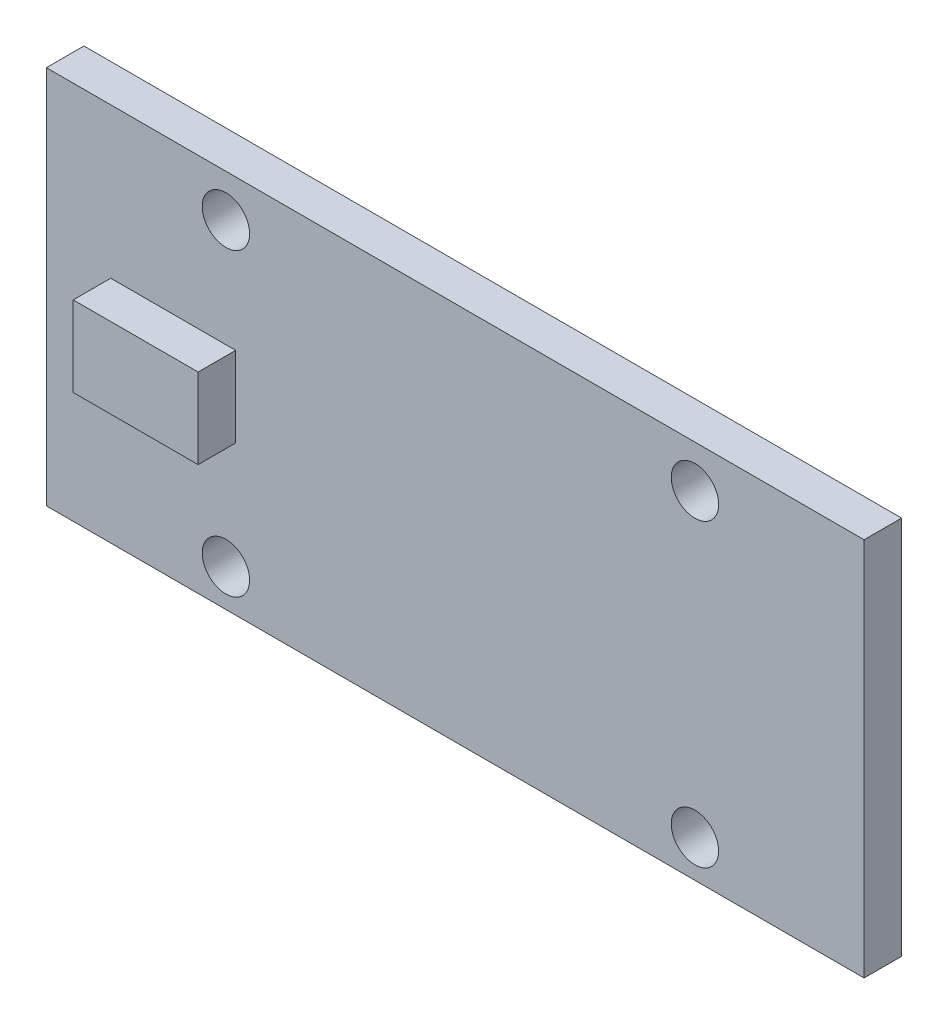
ISO-10303-21;
HEADER;
FILE_DESCRIPTION(('STEP AP214'),'2;1');
FILE_NAME('part.step','',(''),(''),'','','');
FILE_SCHEMA(('AUTOMOTIVE_DESIGN { 1 0 10303 214 1 1 1 1 }'));
ENDSEC;
DATA;
#1=APPLICATION_CONTEXT('core data for automotive mechanical design processes');
#2=APPLICATION_PROTOCOL_DEFINITION('international standard','automotive_design',2000,#1);
#3=PRODUCT_CONTEXT('',#1,'mechanical');
#4=PRODUCT('Part','Part','',(#3));
#5=PRODUCT_RELATED_PRODUCT_CATEGORY('part','',(#4));
#6=PRODUCT_DEFINITION_FORMATION('','',#4);
#7=PRODUCT_DEFINITION_CONTEXT('part definition',#1,'design');
#8=PRODUCT_DEFINITION('design','',#6,#7);
#9=PRODUCT_DEFINITION_SHAPE('','',#8);
#10=(LENGTH_UNIT() NAMED_UNIT(*) SI_UNIT(.MILLI.,.METRE.));
#11=(NAMED_UNIT(*) PLANE_ANGLE_UNIT() SI_UNIT($,.RADIAN.));
#12=(NAMED_UNIT(*) SI_UNIT($,.STERADIAN.) SOLID_ANGLE_UNIT());
#13=UNCERTAINTY_MEASURE_WITH_UNIT(LENGTH_MEASURE(1.E-05),#10,'distance_accuracy_value','');
#14=(GEOMETRIC_REPRESENTATION_CONTEXT(3) GLOBAL_UNCERTAINTY_ASSIGNED_CONTEXT((#13)) GLOBAL_UNIT_ASSIGNED_CONTEXT((#10,
#11,#12)) REPRESENTATION_CONTEXT('',''));
#15=CARTESIAN_POINT('',(0.,0.,0.));
#16=DIRECTION('',(0.,0.,1.));
#17=DIRECTION('',(1.,0.,0.));
#18=AXIS2_PLACEMENT_3D('',#15,#16,#17);
#19=CARTESIAN_POINT('',(0.,0.,2.54));
#20=DIRECTION('',(0.,0.,-1.));
#21=DIRECTION('',(-1.,0.,0.));
#22=AXIS2_PLACEMENT_3D('',#19,#20,#21);
#23=PLANE('',#22);
#24=CARTESIAN_POINT('',(12.1521793794001,22.833985209276,2.54));
#25=DIRECTION('',(0.,0.,1.));
#26=DIRECTION('',(1.,0.,0.));
#27=AXIS2_PLACEMENT_3D('',#24,#25,#26);
#28=CIRCLE('',#27,1.60457553684994);
#29=CARTESIAN_POINT('',(13.75675491625,22.833985209276,2.54));
#30=VERTEX_POINT('',#29);
#31=EDGE_CURVE('E122',#30,#30,#28,.T.);
#32=ORIENTED_EDGE('',*,*,#31,.F.);
#33=EDGE_LOOP('',(#32));
#34=FACE_BOUND('',#33,.T.);
#35=CARTESIAN_POINT('',(43.9021793794001,22.833985209276,2.54));
#36=DIRECTION('',(0.,0.,1.));
#37=DIRECTION('',(1.,0.,0.));
#38=AXIS2_PLACEMENT_3D('',#35,#36,#37);
#39=CIRCLE('',#38,1.60457553684994);
#40=CARTESIAN_POINT('',(45.50675491625,22.833985209276,2.54));
#41=VERTEX_POINT('',#40);
#42=EDGE_CURVE('E131',#41,#41,#39,.T.);
#43=ORIENTED_EDGE('',*,*,#42,.F.);
#44=EDGE_LOOP('',(#43));
#45=FACE_BOUND('',#44,.T.);
#46=CARTESIAN_POINT('',(43.9021793794002,2.51398520927599,2.54));
#47=DIRECTION('',(0.,0.,1.));
#48=DIRECTION('',(1.,0.,0.));
#49=AXIS2_PLACEMENT_3D('',#46,#47,#48);
#50=CIRCLE('',#49,1.60457553684994);
#51=CARTESIAN_POINT('',(45.5067549162501,2.51398520927599,2.54));
#52=VERTEX_POINT('',#51);
#53=EDGE_CURVE('E137',#52,#52,#50,.T.);
#54=ORIENTED_EDGE('',*,*,#53,.F.);
#55=EDGE_LOOP('',(#54));
#56=FACE_BOUND('',#55,.T.);
#57=CARTESIAN_POINT('',(12.1521793794002,2.51398520927599,2.54));
#58=DIRECTION('',(0.,0.,1.));
#59=DIRECTION('',(1.,0.,0.));
#60=AXIS2_PLACEMENT_3D('',#57,#58,#59);
#61=CIRCLE('',#60,1.60457553684994);
#62=CARTESIAN_POINT('',(13.7567549162501,2.51398520927599,2.54));
#63=VERTEX_POINT('',#62);
#64=EDGE_CURVE('E143',#63,#63,#61,.T.);
#65=ORIENTED_EDGE('',*,*,#64,.F.);
#66=EDGE_LOOP('',(#65));
#67=FACE_BOUND('',#66,.T.);
#68=DIRECTION('',(0.,-1.,0.));
#69=VECTOR('',#68,1.);
#70=CARTESIAN_POINT('',(0.,0.,2.54));
#71=LINE('',#70,#69);
#72=CARTESIAN_POINT('',(0.,25.6924756407084,2.54));
#73=VERTEX_POINT('',#72);
#74=CARTESIAN_POINT('',(0.,0.,2.54));
#75=VERTEX_POINT('',#74);
#76=EDGE_CURVE('E149',#73,#75,#71,.T.);
#77=ORIENTED_EDGE('',*,*,#76,.T.);
#78=DIRECTION('',(1.,0.,0.));
#79=VECTOR('',#78,1.);
#80=CARTESIAN_POINT('',(0.,0.,2.54));
#81=LINE('',#80,#79);
#82=CARTESIAN_POINT('',(55.3519209737932,0.,2.54));
#83=VERTEX_POINT('',#82);
#84=EDGE_CURVE('E152',#75,#83,#81,.T.);
#85=ORIENTED_EDGE('',*,*,#84,.T.);
#86=DIRECTION('',(0.,1.,0.));
#87=VECTOR('',#86,1.);
#88=CARTESIAN_POINT('',(55.3519209737932,0.,2.54));
#89=LINE('',#88,#87);
#90=CARTESIAN_POINT('',(55.3519209737932,25.6924756407084,2.54));
#91=VERTEX_POINT('',#90);
#92=EDGE_CURVE('E155',#83,#91,#89,.T.);
#93=ORIENTED_EDGE('',*,*,#92,.T.);
#94=DIRECTION('',(-1.,0.,0.));
#95=VECTOR('',#94,1.);
#96=CARTESIAN_POINT('',(0.,25.6924756407084,2.54));
#97=LINE('',#96,#95);
#98=EDGE_CURVE('E157',#91,#73,#97,.T.);
#99=ORIENTED_EDGE('',*,*,#98,.T.);
#100=EDGE_LOOP('',(#77,#85,#93,#99));
#101=FACE_BOUND('',#100,.T.);
#102=DIRECTION('',(0.,-1.,0.));
#103=VECTOR('',#102,1.);
#104=CARTESIAN_POINT('',(4.35580865105578,15.5257800285256,2.54));
#105=LINE('',#104,#103);
#106=CARTESIAN_POINT('',(4.35580865105578,15.5257800285256,2.54));
#107=VERTEX_POINT('',#106);
#108=CARTESIAN_POINT('',(4.35580865105578,10.0961314259962,2.54));
#109=VERTEX_POINT('',#108);
#110=EDGE_CURVE('E118',#107,#109,#105,.T.);
#111=ORIENTED_EDGE('',*,*,#110,.F.);
#112=DIRECTION('',(-1.,0.,0.));
#113=VECTOR('',#112,1.);
#114=CARTESIAN_POINT('',(4.35580865105578,15.5257800285256,2.54));
#115=LINE('',#114,#113);
#116=CARTESIAN_POINT('',(12.811944246323,15.5257800285256,2.54));
#117=VERTEX_POINT('',#116);
#118=EDGE_CURVE('E115',#117,#107,#115,.T.);
#119=ORIENTED_EDGE('',*,*,#118,.F.);
#120=DIRECTION('',(0.,1.,0.));
#121=VECTOR('',#120,1.);
#122=CARTESIAN_POINT('',(12.811944246323,15.5257800285256,2.54));
#123=LINE('',#122,#121);
#124=CARTESIAN_POINT('',(12.811944246323,10.0961314259962,2.54));
#125=VERTEX_POINT('',#124);
#126=EDGE_CURVE('E53',#125,#117,#123,.T.);
#127=ORIENTED_EDGE('',*,*,#126,.F.);
#128=DIRECTION('',(1.,0.,0.));
#129=VECTOR('',#128,1.);
#130=CARTESIAN_POINT('',(4.35580865105578,10.0961314259962,2.54));
#131=LINE('',#130,#129);
#132=EDGE_CURVE('E48',#109,#125,#131,.T.);
#133=ORIENTED_EDGE('',*,*,#132,.F.);
#134=EDGE_LOOP('',(#111,#119,#127,#133));
#135=FACE_BOUND('',#134,.T.);
#136=ADVANCED_FACE('F33',(#34,#45,#56,#67,#101,#135),#23,.F.);
#137=CARTESIAN_POINT('',(0.,0.,0.));
#138=DIRECTION('',(0.,0.,-1.));
#139=DIRECTION('',(-1.,0.,0.));
#140=AXIS2_PLACEMENT_3D('',#137,#138,#139);
#141=PLANE('',#140);
#142=CARTESIAN_POINT('',(43.9021793794001,22.833985209276,0.));
#143=DIRECTION('',(0.,0.,1.));
#144=DIRECTION('',(1.,0.,0.));
#145=AXIS2_PLACEMENT_3D('',#142,#143,#144);
#146=CIRCLE('',#145,1.60457553684994);
#147=CARTESIAN_POINT('',(45.50675491625,22.833985209276,0.));
#148=VERTEX_POINT('',#147);
#149=EDGE_CURVE('E129',#148,#148,#146,.T.);
#150=ORIENTED_EDGE('',*,*,#149,.T.);
#151=EDGE_LOOP('',(#150));
#152=FACE_BOUND('',#151,.T.);
#153=CARTESIAN_POINT('',(12.1521793794002,2.51398520927599,0.));
#154=DIRECTION('',(0.,0.,1.));
#155=DIRECTION('',(1.,0.,0.));
#156=AXIS2_PLACEMENT_3D('',#153,#154,#155);
#157=CIRCLE('',#156,1.60457553684994);
#158=CARTESIAN_POINT('',(13.7567549162501,2.51398520927599,0.));
#159=VERTEX_POINT('',#158);
#160=EDGE_CURVE('E140',#159,#159,#157,.T.);
#161=ORIENTED_EDGE('',*,*,#160,.T.);
#162=EDGE_LOOP('',(#161));
#163=FACE_BOUND('',#162,.T.);
#164=DIRECTION('',(0.,-1.,0.));
#165=VECTOR('',#164,1.);
#166=CARTESIAN_POINT('',(0.,0.,0.));
#167=LINE('',#166,#165);
#168=CARTESIAN_POINT('',(0.,25.6924756407084,0.));
#169=VERTEX_POINT('',#168);
#170=CARTESIAN_POINT('',(0.,0.,0.));
#171=VERTEX_POINT('',#170);
#172=EDGE_CURVE('E146',#169,#171,#167,.T.);
#173=ORIENTED_EDGE('',*,*,#172,.F.);
#174=DIRECTION('',(-1.,0.,0.));
#175=VECTOR('',#174,1.);
#176=CARTESIAN_POINT('',(0.,25.6924756407084,0.));
#177=LINE('',#176,#175);
#178=CARTESIAN_POINT('',(55.3519209737932,25.6924756407084,0.));
#179=VERTEX_POINT('',#178);
#180=EDGE_CURVE('E153',#179,#169,#177,.T.);
#181=ORIENTED_EDGE('',*,*,#180,.F.);
#182=DIRECTION('',(0.,1.,0.));
#183=VECTOR('',#182,1.);
#184=CARTESIAN_POINT('',(55.3519209737932,0.,0.));
#185=LINE('',#184,#183);
#186=CARTESIAN_POINT('',(55.3519209737932,0.,0.));
#187=VERTEX_POINT('',#186);
#188=EDGE_CURVE('E164',#187,#179,#185,.T.);
#189=ORIENTED_EDGE('',*,*,#188,.F.);
#190=DIRECTION('',(1.,0.,0.));
#191=VECTOR('',#190,1.);
#192=CARTESIAN_POINT('',(0.,0.,0.));
#193=LINE('',#192,#191);
#194=EDGE_CURVE('E162',#171,#187,#193,.T.);
#195=ORIENTED_EDGE('',*,*,#194,.F.);
#196=EDGE_LOOP('',(#173,#181,#189,#195));
#197=FACE_BOUND('',#196,.T.);
#198=CARTESIAN_POINT('',(43.9021793794002,2.51398520927599,0.));
#199=DIRECTION('',(0.,0.,1.));
#200=DIRECTION('',(1.,0.,0.));
#201=AXIS2_PLACEMENT_3D('',#198,#199,#200);
#202=CIRCLE('',#201,1.60457553684994);
#203=CARTESIAN_POINT('',(45.5067549162501,2.51398520927599,0.));
#204=VERTEX_POINT('',#203);
#205=EDGE_CURVE('E134',#204,#204,#202,.T.);
#206=ORIENTED_EDGE('',*,*,#205,.T.);
#207=EDGE_LOOP('',(#206));
#208=FACE_BOUND('',#207,.T.);
#209=CARTESIAN_POINT('',(12.1521793794001,22.833985209276,0.));
#210=DIRECTION('',(0.,0.,1.));
#211=DIRECTION('',(1.,0.,0.));
#212=AXIS2_PLACEMENT_3D('',#209,#210,#211);
#213=CIRCLE('',#212,1.60457553684994);
#214=CARTESIAN_POINT('',(13.75675491625,22.833985209276,0.));
#215=VERTEX_POINT('',#214);
#216=EDGE_CURVE('E119',#215,#215,#213,.T.);
#217=ORIENTED_EDGE('',*,*,#216,.T.);
#218=EDGE_LOOP('',(#217));
#219=FACE_BOUND('',#218,.T.);
#220=ADVANCED_FACE('F182',(#152,#163,#197,#208,#219),#141,.T.);
#221=CARTESIAN_POINT('',(0.,0.,2.54));
#222=DIRECTION('',(1.,0.,0.));
#223=DIRECTION('',(0.,0.,-1.));
#224=AXIS2_PLACEMENT_3D('',#221,#222,#223);
#225=PLANE('',#224);
#226=ORIENTED_EDGE('',*,*,#172,.T.);
#227=DIRECTION('',(0.,0.,-1.));
#228=VECTOR('',#227,1.);
#229=CARTESIAN_POINT('',(0.,0.,2.54));
#230=LINE('',#229,#228);
#231=EDGE_CURVE('E11',#75,#171,#230,.T.);
#232=ORIENTED_EDGE('',*,*,#231,.F.);
#233=ORIENTED_EDGE('',*,*,#76,.F.);
#234=DIRECTION('',(0.,0.,-1.));
#235=VECTOR('',#234,1.);
#236=CARTESIAN_POINT('',(0.,25.6924756407084,2.54));
#237=LINE('',#236,#235);
#238=EDGE_CURVE('E159',#73,#169,#237,.T.);
#239=ORIENTED_EDGE('',*,*,#238,.T.);
#240=EDGE_LOOP('',(#226,#232,#233,#239));
#241=FACE_BOUND('',#240,.T.);
#242=ADVANCED_FACE('F35',(#241),#225,.F.);
#243=CARTESIAN_POINT('',(0.,0.,2.54));
#244=DIRECTION('',(0.,1.,0.));
#245=DIRECTION('',(0.,0.,1.));
#246=AXIS2_PLACEMENT_3D('',#243,#244,#245);
#247=PLANE('',#246);
#248=ORIENTED_EDGE('',*,*,#194,.T.);
#249=DIRECTION('',(0.,0.,-1.));
#250=VECTOR('',#249,1.);
#251=CARTESIAN_POINT('',(55.3519209737932,0.,2.54));
#252=LINE('',#251,#250);
#253=EDGE_CURVE('E41',#83,#187,#252,.T.);
#254=ORIENTED_EDGE('',*,*,#253,.F.);
#255=ORIENTED_EDGE('',*,*,#84,.F.);
#256=ORIENTED_EDGE('',*,*,#231,.T.);
#257=EDGE_LOOP('',(#248,#254,#255,#256));
#258=FACE_BOUND('',#257,.T.);
#259=ADVANCED_FACE('F192',(#258),#247,.F.);
#260=CARTESIAN_POINT('',(55.3519209737932,0.,2.54));
#261=DIRECTION('',(-1.,0.,0.));
#262=DIRECTION('',(0.,0.,1.));
#263=AXIS2_PLACEMENT_3D('',#260,#261,#262);
#264=PLANE('',#263);
#265=ORIENTED_EDGE('',*,*,#188,.T.);
#266=DIRECTION('',(0.,0.,-1.));
#267=VECTOR('',#266,1.);
#268=CARTESIAN_POINT('',(55.3519209737932,25.6924756407084,2.54));
#269=LINE('',#268,#267);
#270=EDGE_CURVE('E169',#91,#179,#269,.T.);
#271=ORIENTED_EDGE('',*,*,#270,.F.);
#272=ORIENTED_EDGE('',*,*,#92,.F.);
#273=ORIENTED_EDGE('',*,*,#253,.T.);
#274=EDGE_LOOP('',(#265,#271,#272,#273));
#275=FACE_BOUND('',#274,.T.);
#276=ADVANCED_FACE('F176',(#275),#264,.F.);
#277=CARTESIAN_POINT('',(0.,25.6924756407084,2.54));
#278=DIRECTION('',(0.,-1.,0.));
#279=DIRECTION('',(0.,0.,-1.));
#280=AXIS2_PLACEMENT_3D('',#277,#278,#279);
#281=PLANE('',#280);
#282=ORIENTED_EDGE('',*,*,#180,.T.);
#283=ORIENTED_EDGE('',*,*,#238,.F.);
#284=ORIENTED_EDGE('',*,*,#98,.F.);
#285=ORIENTED_EDGE('',*,*,#270,.T.);
#286=EDGE_LOOP('',(#282,#283,#284,#285));
#287=FACE_BOUND('',#286,.T.);
#288=ADVANCED_FACE('F186',(#287),#281,.F.);
#289=CARTESIAN_POINT('',(12.1521793794002,2.51398520927599,2.54));
#290=DIRECTION('',(0.,0.,-1.));
#291=DIRECTION('',(-1.,0.,0.));
#292=AXIS2_PLACEMENT_3D('',#289,#290,#291);
#293=CYLINDRICAL_SURFACE('',#292,1.60457553684994);
#294=ORIENTED_EDGE('',*,*,#64,.T.);
#295=EDGE_LOOP('',(#294));
#296=FACE_BOUND('',#295,.T.);
#297=ORIENTED_EDGE('',*,*,#160,.F.);
#298=EDGE_LOOP('',(#297));
#299=FACE_BOUND('',#298,.T.);
#300=ADVANCED_FACE('F212',(#296,#299),#293,.F.);
#301=CARTESIAN_POINT('',(43.9021793794002,2.51398520927599,2.54));
#302=DIRECTION('',(0.,0.,-1.));
#303=DIRECTION('',(-1.,0.,0.));
#304=AXIS2_PLACEMENT_3D('',#301,#302,#303);
#305=CYLINDRICAL_SURFACE('',#304,1.60457553684994);
#306=ORIENTED_EDGE('',*,*,#53,.T.);
#307=EDGE_LOOP('',(#306));
#308=FACE_BOUND('',#307,.T.);
#309=ORIENTED_EDGE('',*,*,#205,.F.);
#310=EDGE_LOOP('',(#309));
#311=FACE_BOUND('',#310,.T.);
#312=ADVANCED_FACE('F219',(#308,#311),#305,.F.);
#313=CARTESIAN_POINT('',(43.9021793794001,22.833985209276,2.54));
#314=DIRECTION('',(0.,0.,-1.));
#315=DIRECTION('',(-1.,0.,0.));
#316=AXIS2_PLACEMENT_3D('',#313,#314,#315);
#317=CYLINDRICAL_SURFACE('',#316,1.60457553684994);
#318=ORIENTED_EDGE('',*,*,#42,.T.);
#319=EDGE_LOOP('',(#318));
#320=FACE_BOUND('',#319,.T.);
#321=ORIENTED_EDGE('',*,*,#149,.F.);
#322=EDGE_LOOP('',(#321));
#323=FACE_BOUND('',#322,.T.);
#324=ADVANCED_FACE('F224',(#320,#323),#317,.F.);
#325=CARTESIAN_POINT('',(12.1521793794001,22.833985209276,2.54));
#326=DIRECTION('',(0.,0.,-1.));
#327=DIRECTION('',(-1.,0.,0.));
#328=AXIS2_PLACEMENT_3D('',#325,#326,#327);
#329=CYLINDRICAL_SURFACE('',#328,1.60457553684994);
#330=ORIENTED_EDGE('',*,*,#31,.T.);
#331=EDGE_LOOP('',(#330));
#332=FACE_BOUND('',#331,.T.);
#333=ORIENTED_EDGE('',*,*,#216,.F.);
#334=EDGE_LOOP('',(#333));
#335=FACE_BOUND('',#334,.T.);
#336=ADVANCED_FACE('F234',(#332,#335),#329,.F.);
#337=CARTESIAN_POINT('',(4.35580865105578,15.5257800285256,5.08));
#338=DIRECTION('',(1.,0.,0.));
#339=DIRECTION('',(0.,0.,-1.));
#340=AXIS2_PLACEMENT_3D('',#337,#338,#339);
#341=PLANE('',#340);
#342=ORIENTED_EDGE('',*,*,#110,.T.);
#343=DIRECTION('',(0.,0.,-1.));
#344=VECTOR('',#343,1.);
#345=CARTESIAN_POINT('',(4.35580865105578,10.0961314259962,5.08));
#346=LINE('',#345,#344);
#347=CARTESIAN_POINT('',(4.35580865105578,10.0961314259962,5.08));
#348=VERTEX_POINT('',#347);
#349=EDGE_CURVE('E99',#348,#109,#346,.T.);
#350=ORIENTED_EDGE('',*,*,#349,.F.);
#351=DIRECTION('',(0.,-1.,0.));
#352=VECTOR('',#351,1.);
#353=CARTESIAN_POINT('',(4.35580865105578,15.5257800285256,5.08));
#354=LINE('',#353,#352);
#355=CARTESIAN_POINT('',(4.35580865105578,15.5257800285256,5.08));
#356=VERTEX_POINT('',#355);
#357=EDGE_CURVE('E106',#356,#348,#354,.T.);
#358=ORIENTED_EDGE('',*,*,#357,.F.);
#359=DIRECTION('',(0.,0.,-1.));
#360=VECTOR('',#359,1.);
#361=CARTESIAN_POINT('',(4.35580865105578,15.5257800285256,5.08));
#362=LINE('',#361,#360);
#363=EDGE_CURVE('E335',#356,#107,#362,.T.);
#364=ORIENTED_EDGE('',*,*,#363,.T.);
#365=EDGE_LOOP('',(#342,#350,#358,#364));
#366=FACE_BOUND('',#365,.T.);
#367=ADVANCED_FACE('F117',(#366),#341,.F.);
#368=CARTESIAN_POINT('',(4.35580865105578,10.0961314259962,5.08));
#369=DIRECTION('',(0.,1.,0.));
#370=DIRECTION('',(0.,0.,1.));
#371=AXIS2_PLACEMENT_3D('',#368,#369,#370);
#372=PLANE('',#371);
#373=ORIENTED_EDGE('',*,*,#132,.T.);
#374=DIRECTION('',(0.,0.,-1.));
#375=VECTOR('',#374,1.);
#376=CARTESIAN_POINT('',(12.811944246323,10.0961314259962,5.08));
#377=LINE('',#376,#375);
#378=CARTESIAN_POINT('',(12.811944246323,10.0961314259962,5.08));
#379=VERTEX_POINT('',#378);
#380=EDGE_CURVE('E102',#379,#125,#377,.T.);
#381=ORIENTED_EDGE('',*,*,#380,.F.);
#382=DIRECTION('',(1.,0.,0.));
#383=VECTOR('',#382,1.);
#384=CARTESIAN_POINT('',(4.35580865105578,10.0961314259962,5.08));
#385=LINE('',#384,#383);
#386=EDGE_CURVE('E95',#348,#379,#385,.T.);
#387=ORIENTED_EDGE('',*,*,#386,.F.);
#388=ORIENTED_EDGE('',*,*,#349,.T.);
#389=EDGE_LOOP('',(#373,#381,#387,#388));
#390=FACE_BOUND('',#389,.T.);
#391=ADVANCED_FACE('F97',(#390),#372,.F.);
#392=CARTESIAN_POINT('',(12.811944246323,15.5257800285256,5.08));
#393=DIRECTION('',(-1.,0.,0.));
#394=DIRECTION('',(0.,0.,1.));
#395=AXIS2_PLACEMENT_3D('',#392,#393,#394);
#396=PLANE('',#395);
#397=ORIENTED_EDGE('',*,*,#126,.T.);
#398=DIRECTION('',(0.,0.,-1.));
#399=VECTOR('',#398,1.);
#400=CARTESIAN_POINT('',(12.811944246323,15.5257800285256,5.08));
#401=LINE('',#400,#399);
#402=CARTESIAN_POINT('',(12.811944246323,15.5257800285256,5.08));
#403=VERTEX_POINT('',#402);
#404=EDGE_CURVE('E124',#403,#117,#401,.T.);
#405=ORIENTED_EDGE('',*,*,#404,.F.);
#406=DIRECTION('',(0.,1.,0.));
#407=VECTOR('',#406,1.);
#408=CARTESIAN_POINT('',(12.811944246323,15.5257800285256,5.08));
#409=LINE('',#408,#407);
#410=EDGE_CURVE('E105',#379,#403,#409,.T.);
#411=ORIENTED_EDGE('',*,*,#410,.F.);
#412=ORIENTED_EDGE('',*,*,#380,.T.);
#413=EDGE_LOOP('',(#397,#405,#411,#412));
#414=FACE_BOUND('',#413,.T.);
#415=ADVANCED_FACE('F246',(#414),#396,.F.);
#416=CARTESIAN_POINT('',(4.35580865105578,15.5257800285256,5.08));
#417=DIRECTION('',(0.,-1.,0.));
#418=DIRECTION('',(0.,0.,-1.));
#419=AXIS2_PLACEMENT_3D('',#416,#417,#418);
#420=PLANE('',#419);
#421=ORIENTED_EDGE('',*,*,#118,.T.);
#422=ORIENTED_EDGE('',*,*,#363,.F.);
#423=DIRECTION('',(-1.,0.,0.));
#424=VECTOR('',#423,1.);
#425=CARTESIAN_POINT('',(4.35580865105578,15.5257800285256,5.08));
#426=LINE('',#425,#424);
#427=EDGE_CURVE('E111',#403,#356,#426,.T.);
#428=ORIENTED_EDGE('',*,*,#427,.F.);
#429=ORIENTED_EDGE('',*,*,#404,.T.);
#430=EDGE_LOOP('',(#421,#422,#428,#429));
#431=FACE_BOUND('',#430,.T.);
#432=ADVANCED_FACE('F249',(#431),#420,.F.);
#433=CARTESIAN_POINT('',(0.,0.,5.08));
#434=DIRECTION('',(0.,0.,1.));
#435=DIRECTION('',(1.,0.,0.));
#436=AXIS2_PLACEMENT_3D('',#433,#434,#435);
#437=PLANE('',#436);
#438=ORIENTED_EDGE('',*,*,#357,.T.);
#439=ORIENTED_EDGE('',*,*,#386,.T.);
#440=ORIENTED_EDGE('',*,*,#410,.T.);
#441=ORIENTED_EDGE('',*,*,#427,.T.);
#442=EDGE_LOOP('',(#438,#439,#440,#441));
#443=FACE_BOUND('',#442,.T.);
#444=ADVANCED_FACE('F109',(#443),#437,.T.);
#445=CLOSED_SHELL('',(#136,#220,#242,#259,#276,#288,#300,#312,#324,#336,#367,#391,#415,#432,#444));
#446=MANIFOLD_SOLID_BREP('B2',#445);
#447=ADVANCED_BREP_SHAPE_REPRESENTATION('',(#18,#446),#14);
#448=SHAPE_DEFINITION_REPRESENTATION(#9,#447);
ENDSEC;
END-ISO-10303-21;
